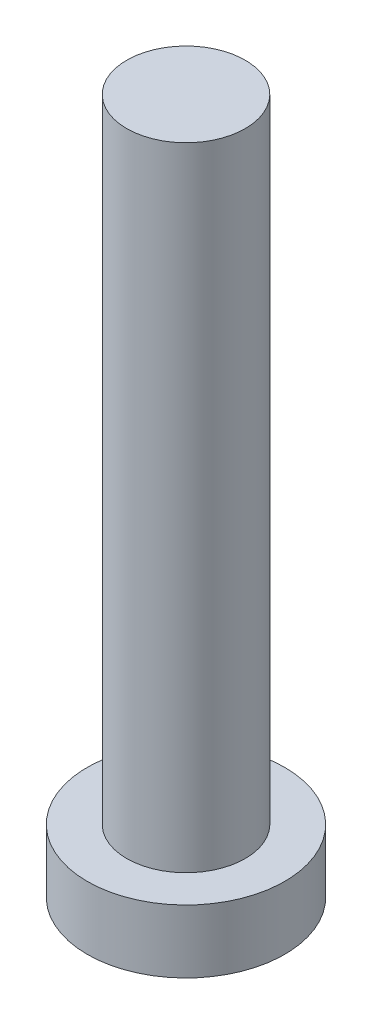
ISO-10303-21;
HEADER;
FILE_DESCRIPTION(('STEP AP214'),'2;1');
FILE_NAME('part.step','',(''),(''),'','','');
FILE_SCHEMA(('AUTOMOTIVE_DESIGN { 1 0 10303 214 1 1 1 1 }'));
ENDSEC;
DATA;
#1=APPLICATION_CONTEXT('core data for automotive mechanical design processes');
#2=APPLICATION_PROTOCOL_DEFINITION('international standard','automotive_design',2000,#1);
#3=PRODUCT_CONTEXT('',#1,'mechanical');
#4=PRODUCT('Part','Part','',(#3));
#5=PRODUCT_RELATED_PRODUCT_CATEGORY('part','',(#4));
#6=PRODUCT_DEFINITION_FORMATION('','',#4);
#7=PRODUCT_DEFINITION_CONTEXT('part definition',#1,'design');
#8=PRODUCT_DEFINITION('design','',#6,#7);
#9=PRODUCT_DEFINITION_SHAPE('','',#8);
#10=(LENGTH_UNIT() NAMED_UNIT(*) SI_UNIT(.MILLI.,.METRE.));
#11=(NAMED_UNIT(*) PLANE_ANGLE_UNIT() SI_UNIT($,.RADIAN.));
#12=(NAMED_UNIT(*) SI_UNIT($,.STERADIAN.) SOLID_ANGLE_UNIT());
#13=UNCERTAINTY_MEASURE_WITH_UNIT(LENGTH_MEASURE(1.E-05),#10,'distance_accuracy_value','');
#14=(GEOMETRIC_REPRESENTATION_CONTEXT(3) GLOBAL_UNCERTAINTY_ASSIGNED_CONTEXT((#13)) GLOBAL_UNIT_ASSIGNED_CONTEXT((#10,
#11,#12)) REPRESENTATION_CONTEXT('',''));
#15=CARTESIAN_POINT('',(0.,0.,0.));
#16=DIRECTION('',(0.,0.,1.));
#17=DIRECTION('',(1.,0.,0.));
#18=AXIS2_PLACEMENT_3D('',#15,#16,#17);
#19=CARTESIAN_POINT('',(0.,0.,0.));
#20=DIRECTION('',(0.,1.,0.));
#21=DIRECTION('',(0.,0.,1.));
#22=AXIS2_PLACEMENT_3D('',#19,#20,#21);
#23=PLANE('',#22);
#24=CARTESIAN_POINT('',(0.,0.,0.));
#25=DIRECTION('',(0.,1.,0.));
#26=DIRECTION('',(0.,0.,1.));
#27=AXIS2_PLACEMENT_3D('',#24,#25,#26);
#28=CIRCLE('',#27,2.5);
#29=CARTESIAN_POINT('',(0.,0.,2.5));
#30=VERTEX_POINT('',#29);
#31=EDGE_CURVE('E39',#30,#30,#28,.T.);
#32=ORIENTED_EDGE('',*,*,#31,.F.);
#33=EDGE_LOOP('',(#32));
#34=FACE_BOUND('',#33,.T.);
#35=CARTESIAN_POINT('',(1.,0.,1.));
#36=DIRECTION('',(0.,1.,0.));
#37=DIRECTION('',(0.,0.,-1.));
#38=AXIS2_PLACEMENT_3D('',#35,#36,#37);
#39=CIRCLE('',#38,0.5);
#40=CARTESIAN_POINT('',(1.,0.,0.5));
#41=VERTEX_POINT('',#40);
#42=CARTESIAN_POINT('',(0.5,0.,1.));
#43=VERTEX_POINT('',#42);
#44=EDGE_CURVE('E186',#41,#43,#39,.T.);
#45=ORIENTED_EDGE('',*,*,#44,.F.);
#46=DIRECTION('',(-1.,0.,0.));
#47=VECTOR('',#46,1.);
#48=CARTESIAN_POINT('',(1.,0.,0.5));
#49=LINE('',#48,#47);
#50=CARTESIAN_POINT('',(1.75,0.,0.5));
#51=VERTEX_POINT('',#50);
#52=EDGE_CURVE('E52',#51,#41,#49,.T.);
#53=ORIENTED_EDGE('',*,*,#52,.F.);
#54=DIRECTION('',(0.,0.,1.));
#55=VECTOR('',#54,1.);
#56=CARTESIAN_POINT('',(1.75,0.,-0.5));
#57=LINE('',#56,#55);
#58=CARTESIAN_POINT('',(1.75,0.,-0.5));
#59=VERTEX_POINT('',#58);
#60=EDGE_CURVE('E225',#59,#51,#57,.T.);
#61=ORIENTED_EDGE('',*,*,#60,.F.);
#62=DIRECTION('',(1.,0.,0.));
#63=VECTOR('',#62,1.);
#64=CARTESIAN_POINT('',(1.,0.,-0.5));
#65=LINE('',#64,#63);
#66=CARTESIAN_POINT('',(1.,0.,-0.5));
#67=VERTEX_POINT('',#66);
#68=EDGE_CURVE('E223',#67,#59,#65,.T.);
#69=ORIENTED_EDGE('',*,*,#68,.F.);
#70=CARTESIAN_POINT('',(1.,0.,-1.));
#71=DIRECTION('',(0.,1.,0.));
#72=DIRECTION('',(0.,0.,-1.));
#73=AXIS2_PLACEMENT_3D('',#70,#71,#72);
#74=CIRCLE('',#73,0.5);
#75=CARTESIAN_POINT('',(0.5,0.,-1.));
#76=VERTEX_POINT('',#75);
#77=EDGE_CURVE('E160',#76,#67,#74,.T.);
#78=ORIENTED_EDGE('',*,*,#77,.F.);
#79=DIRECTION('',(0.,0.,1.));
#80=VECTOR('',#79,1.);
#81=CARTESIAN_POINT('',(0.5,0.,-1.75));
#82=LINE('',#81,#80);
#83=CARTESIAN_POINT('',(0.5,0.,-1.75));
#84=VERTEX_POINT('',#83);
#85=EDGE_CURVE('E219',#84,#76,#82,.T.);
#86=ORIENTED_EDGE('',*,*,#85,.F.);
#87=DIRECTION('',(1.,0.,0.));
#88=VECTOR('',#87,1.);
#89=CARTESIAN_POINT('',(-0.5,0.,-1.75));
#90=LINE('',#89,#88);
#91=CARTESIAN_POINT('',(-0.5,0.,-1.75));
#92=VERTEX_POINT('',#91);
#93=EDGE_CURVE('E216',#92,#84,#90,.T.);
#94=ORIENTED_EDGE('',*,*,#93,.F.);
#95=DIRECTION('',(0.,0.,-1.));
#96=VECTOR('',#95,1.);
#97=CARTESIAN_POINT('',(-0.5,0.,-1.75));
#98=LINE('',#97,#96);
#99=CARTESIAN_POINT('',(-0.5,0.,-1.));
#100=VERTEX_POINT('',#99);
#101=EDGE_CURVE('E213',#100,#92,#98,.T.);
#102=ORIENTED_EDGE('',*,*,#101,.F.);
#103=CARTESIAN_POINT('',(-1.,0.,-1.));
#104=DIRECTION('',(0.,1.,0.));
#105=DIRECTION('',(0.,0.,-1.));
#106=AXIS2_PLACEMENT_3D('',#103,#104,#105);
#107=CIRCLE('',#106,0.5);
#108=CARTESIAN_POINT('',(-1.,0.,-0.5));
#109=VERTEX_POINT('',#108);
#110=EDGE_CURVE('E210',#109,#100,#107,.T.);
#111=ORIENTED_EDGE('',*,*,#110,.F.);
#112=DIRECTION('',(1.,0.,0.));
#113=VECTOR('',#112,1.);
#114=CARTESIAN_POINT('',(-1.75,0.,-0.5));
#115=LINE('',#114,#113);
#116=CARTESIAN_POINT('',(-1.75,0.,-0.5));
#117=VERTEX_POINT('',#116);
#118=EDGE_CURVE('E207',#117,#109,#115,.T.);
#119=ORIENTED_EDGE('',*,*,#118,.F.);
#120=DIRECTION('',(0.,0.,-1.));
#121=VECTOR('',#120,1.);
#122=CARTESIAN_POINT('',(-1.75,0.,-0.5));
#123=LINE('',#122,#121);
#124=CARTESIAN_POINT('',(-1.75,0.,0.5));
#125=VERTEX_POINT('',#124);
#126=EDGE_CURVE('E204',#125,#117,#123,.T.);
#127=ORIENTED_EDGE('',*,*,#126,.F.);
#128=DIRECTION('',(-1.,0.,0.));
#129=VECTOR('',#128,1.);
#130=CARTESIAN_POINT('',(-1.75,0.,0.5));
#131=LINE('',#130,#129);
#132=CARTESIAN_POINT('',(-1.,0.,0.5));
#133=VERTEX_POINT('',#132);
#134=EDGE_CURVE('E201',#133,#125,#131,.T.);
#135=ORIENTED_EDGE('',*,*,#134,.F.);
#136=CARTESIAN_POINT('',(-1.,0.,1.));
#137=DIRECTION('',(0.,1.,0.));
#138=DIRECTION('',(0.,0.,1.));
#139=AXIS2_PLACEMENT_3D('',#136,#137,#138);
#140=CIRCLE('',#139,0.5);
#141=CARTESIAN_POINT('',(-0.5,0.,1.));
#142=VERTEX_POINT('',#141);
#143=EDGE_CURVE('E198',#142,#133,#140,.T.);
#144=ORIENTED_EDGE('',*,*,#143,.F.);
#145=DIRECTION('',(0.,0.,-1.));
#146=VECTOR('',#145,1.);
#147=CARTESIAN_POINT('',(-0.5,0.,1.));
#148=LINE('',#147,#146);
#149=CARTESIAN_POINT('',(-0.5,0.,1.75));
#150=VERTEX_POINT('',#149);
#151=EDGE_CURVE('E195',#150,#142,#148,.T.);
#152=ORIENTED_EDGE('',*,*,#151,.F.);
#153=DIRECTION('',(-1.,0.,0.));
#154=VECTOR('',#153,1.);
#155=CARTESIAN_POINT('',(-0.5,0.,1.75));
#156=LINE('',#155,#154);
#157=CARTESIAN_POINT('',(0.5,0.,1.75));
#158=VERTEX_POINT('',#157);
#159=EDGE_CURVE('E192',#158,#150,#156,.T.);
#160=ORIENTED_EDGE('',*,*,#159,.F.);
#161=DIRECTION('',(0.,0.,1.));
#162=VECTOR('',#161,1.);
#163=CARTESIAN_POINT('',(0.5,0.,1.));
#164=LINE('',#163,#162);
#165=EDGE_CURVE('E189',#43,#158,#164,.T.);
#166=ORIENTED_EDGE('',*,*,#165,.F.);
#167=EDGE_LOOP('',(#45,#53,#61,#69,#78,#86,#94,#102,#111,#119,#127,#135,#144,#152,#160,#166));
#168=FACE_BOUND('',#167,.T.);
#169=ADVANCED_FACE('F35',(#34,#168),#23,.F.);
#170=CARTESIAN_POINT('',(0.,1.6,0.));
#171=DIRECTION('',(0.,-1.,0.));
#172=DIRECTION('',(0.,0.,-1.));
#173=AXIS2_PLACEMENT_3D('',#170,#171,#172);
#174=CYLINDRICAL_SURFACE('',#173,2.5);
#175=CARTESIAN_POINT('',(0.,1.6,0.));
#176=DIRECTION('',(0.,1.,0.));
#177=DIRECTION('',(0.,0.,1.));
#178=AXIS2_PLACEMENT_3D('',#175,#176,#177);
#179=CIRCLE('',#178,2.5);
#180=CARTESIAN_POINT('',(0.,1.6,2.5));
#181=VERTEX_POINT('',#180);
#182=EDGE_CURVE('E44',#181,#181,#179,.T.);
#183=ORIENTED_EDGE('',*,*,#182,.F.);
#184=EDGE_LOOP('',(#183));
#185=FACE_BOUND('',#184,.T.);
#186=ORIENTED_EDGE('',*,*,#31,.T.);
#187=EDGE_LOOP('',(#186));
#188=FACE_BOUND('',#187,.T.);
#189=ADVANCED_FACE('F37',(#185,#188),#174,.T.);
#190=CARTESIAN_POINT('',(0.,1.6,0.));
#191=DIRECTION('',(0.,1.,0.));
#192=DIRECTION('',(0.,0.,1.));
#193=AXIS2_PLACEMENT_3D('',#190,#191,#192);
#194=PLANE('',#193);
#195=CARTESIAN_POINT('',(0.,1.6,0.));
#196=DIRECTION('',(0.,1.,0.));
#197=DIRECTION('',(0.,0.,1.));
#198=AXIS2_PLACEMENT_3D('',#195,#196,#197);
#199=CIRCLE('',#198,1.5);
#200=CARTESIAN_POINT('',(0.,1.6,1.5));
#201=VERTEX_POINT('',#200);
#202=EDGE_CURVE('E11',#201,#201,#199,.T.);
#203=ORIENTED_EDGE('',*,*,#202,.F.);
#204=EDGE_LOOP('',(#203));
#205=FACE_BOUND('',#204,.T.);
#206=ORIENTED_EDGE('',*,*,#182,.T.);
#207=EDGE_LOOP('',(#206));
#208=FACE_BOUND('',#207,.T.);
#209=ADVANCED_FACE('F374',(#205,#208),#194,.T.);
#210=CARTESIAN_POINT('',(0.,17.6,0.));
#211=DIRECTION('',(0.,-1.,0.));
#212=DIRECTION('',(0.,0.,-1.));
#213=AXIS2_PLACEMENT_3D('',#210,#211,#212);
#214=CYLINDRICAL_SURFACE('',#213,1.5);
#215=CARTESIAN_POINT('',(0.,17.6,0.));
#216=DIRECTION('',(0.,1.,0.));
#217=DIRECTION('',(0.,0.,1.));
#218=AXIS2_PLACEMENT_3D('',#215,#216,#217);
#219=CIRCLE('',#218,1.5);
#220=CARTESIAN_POINT('',(0.,17.6,1.5));
#221=VERTEX_POINT('',#220);
#222=EDGE_CURVE('E229',#221,#221,#219,.T.);
#223=ORIENTED_EDGE('',*,*,#222,.F.);
#224=EDGE_LOOP('',(#223));
#225=FACE_BOUND('',#224,.T.);
#226=ORIENTED_EDGE('',*,*,#202,.T.);
#227=EDGE_LOOP('',(#226));
#228=FACE_BOUND('',#227,.T.);
#229=ADVANCED_FACE('F370',(#225,#228),#214,.T.);
#230=CARTESIAN_POINT('',(0.,17.6,0.));
#231=DIRECTION('',(0.,1.,0.));
#232=DIRECTION('',(0.,0.,1.));
#233=AXIS2_PLACEMENT_3D('',#230,#231,#232);
#234=PLANE('',#233);
#235=ORIENTED_EDGE('',*,*,#222,.T.);
#236=EDGE_LOOP('',(#235));
#237=FACE_BOUND('',#236,.T.);
#238=ADVANCED_FACE('F320',(#237),#234,.T.);
#239=CARTESIAN_POINT('',(1.,1.,0.5));
#240=DIRECTION('',(0.,0.,1.));
#241=DIRECTION('',(1.,0.,0.));
#242=AXIS2_PLACEMENT_3D('',#239,#240,#241);
#243=PLANE('',#242);
#244=ORIENTED_EDGE('',*,*,#52,.T.);
#245=DIRECTION('',(0.,-1.,0.));
#246=VECTOR('',#245,1.);
#247=CARTESIAN_POINT('',(1.,1.,0.5));
#248=LINE('',#247,#246);
#249=CARTESIAN_POINT('',(1.,1.,0.5));
#250=VERTEX_POINT('',#249);
#251=EDGE_CURVE('E112',#250,#41,#248,.T.);
#252=ORIENTED_EDGE('',*,*,#251,.F.);
#253=DIRECTION('',(-1.,0.,0.));
#254=VECTOR('',#253,1.);
#255=CARTESIAN_POINT('',(1.,1.,0.5));
#256=LINE('',#255,#254);
#257=CARTESIAN_POINT('',(1.75,1.,0.5));
#258=VERTEX_POINT('',#257);
#259=EDGE_CURVE('E227',#258,#250,#256,.T.);
#260=ORIENTED_EDGE('',*,*,#259,.F.);
#261=DIRECTION('',(0.,-1.,0.));
#262=VECTOR('',#261,1.);
#263=CARTESIAN_POINT('',(1.75,1.,0.5));
#264=LINE('',#263,#262);
#265=EDGE_CURVE('E60',#258,#51,#264,.T.);
#266=ORIENTED_EDGE('',*,*,#265,.T.);
#267=EDGE_LOOP('',(#244,#252,#260,#266));
#268=FACE_BOUND('',#267,.T.);
#269=ADVANCED_FACE('F313',(#268),#243,.F.);
#270=CARTESIAN_POINT('',(1.75,1.,-0.5));
#271=DIRECTION('',(1.,0.,0.));
#272=DIRECTION('',(0.,0.,-1.));
#273=AXIS2_PLACEMENT_3D('',#270,#271,#272);
#274=PLANE('',#273);
#275=ORIENTED_EDGE('',*,*,#60,.T.);
#276=ORIENTED_EDGE('',*,*,#265,.F.);
#277=DIRECTION('',(0.,0.,1.));
#278=VECTOR('',#277,1.);
#279=CARTESIAN_POINT('',(1.75,1.,-0.5));
#280=LINE('',#279,#278);
#281=CARTESIAN_POINT('',(1.75,1.,-0.5));
#282=VERTEX_POINT('',#281);
#283=EDGE_CURVE('E172',#282,#258,#280,.T.);
#284=ORIENTED_EDGE('',*,*,#283,.F.);
#285=DIRECTION('',(0.,-1.,0.));
#286=VECTOR('',#285,1.);
#287=CARTESIAN_POINT('',(1.75,1.,-0.5));
#288=LINE('',#287,#286);
#289=EDGE_CURVE('E164',#282,#59,#288,.T.);
#290=ORIENTED_EDGE('',*,*,#289,.T.);
#291=EDGE_LOOP('',(#275,#276,#284,#290));
#292=FACE_BOUND('',#291,.T.);
#293=ADVANCED_FACE('F311',(#292),#274,.F.);
#294=CARTESIAN_POINT('',(1.,1.,-0.5));
#295=DIRECTION('',(0.,0.,-1.));
#296=DIRECTION('',(-1.,0.,0.));
#297=AXIS2_PLACEMENT_3D('',#294,#295,#296);
#298=PLANE('',#297);
#299=ORIENTED_EDGE('',*,*,#68,.T.);
#300=ORIENTED_EDGE('',*,*,#289,.F.);
#301=DIRECTION('',(1.,0.,0.));
#302=VECTOR('',#301,1.);
#303=CARTESIAN_POINT('',(1.,1.,-0.5));
#304=LINE('',#303,#302);
#305=CARTESIAN_POINT('',(1.,1.,-0.5));
#306=VERTEX_POINT('',#305);
#307=EDGE_CURVE('E168',#306,#282,#304,.T.);
#308=ORIENTED_EDGE('',*,*,#307,.F.);
#309=DIRECTION('',(0.,-1.,0.));
#310=VECTOR('',#309,1.);
#311=CARTESIAN_POINT('',(1.,1.,-0.5));
#312=LINE('',#311,#310);
#313=EDGE_CURVE('E153',#306,#67,#312,.T.);
#314=ORIENTED_EDGE('',*,*,#313,.T.);
#315=EDGE_LOOP('',(#299,#300,#308,#314));
#316=FACE_BOUND('',#315,.T.);
#317=ADVANCED_FACE('F169',(#316),#298,.F.);
#318=CARTESIAN_POINT('',(1.,1.,-1.));
#319=DIRECTION('',(0.,-1.,0.));
#320=DIRECTION('',(0.,0.,-1.));
#321=AXIS2_PLACEMENT_3D('',#318,#319,#320);
#322=CYLINDRICAL_SURFACE('',#321,0.5);
#323=ORIENTED_EDGE('',*,*,#77,.T.);
#324=ORIENTED_EDGE('',*,*,#313,.F.);
#325=CARTESIAN_POINT('',(1.,1.,-1.));
#326=DIRECTION('',(0.,1.,0.));
#327=DIRECTION('',(0.,0.,-1.));
#328=AXIS2_PLACEMENT_3D('',#325,#326,#327);
#329=CIRCLE('',#328,0.5);
#330=CARTESIAN_POINT('',(0.5,1.,-1.));
#331=VERTEX_POINT('',#330);
#332=EDGE_CURVE('E157',#331,#306,#329,.T.);
#333=ORIENTED_EDGE('',*,*,#332,.F.);
#334=DIRECTION('',(0.,-1.,0.));
#335=VECTOR('',#334,1.);
#336=CARTESIAN_POINT('',(0.5,1.,-1.));
#337=LINE('',#336,#335);
#338=EDGE_CURVE('E165',#331,#76,#337,.T.);
#339=ORIENTED_EDGE('',*,*,#338,.T.);
#340=EDGE_LOOP('',(#323,#324,#333,#339));
#341=FACE_BOUND('',#340,.T.);
#342=ADVANCED_FACE('F155',(#341),#322,.T.);
#343=CARTESIAN_POINT('',(0.5,1.,-1.75));
#344=DIRECTION('',(1.,0.,0.));
#345=DIRECTION('',(0.,0.,-1.));
#346=AXIS2_PLACEMENT_3D('',#343,#344,#345);
#347=PLANE('',#346);
#348=ORIENTED_EDGE('',*,*,#85,.T.);
#349=ORIENTED_EDGE('',*,*,#338,.F.);
#350=DIRECTION('',(0.,0.,1.));
#351=VECTOR('',#350,1.);
#352=CARTESIAN_POINT('',(0.5,1.,-1.75));
#353=LINE('',#352,#351);
#354=CARTESIAN_POINT('',(0.5,1.,-1.75));
#355=VERTEX_POINT('',#354);
#356=EDGE_CURVE('E178',#355,#331,#353,.T.);
#357=ORIENTED_EDGE('',*,*,#356,.F.);
#358=DIRECTION('',(0.,-1.,0.));
#359=VECTOR('',#358,1.);
#360=CARTESIAN_POINT('',(0.5,1.,-1.75));
#361=LINE('',#360,#359);
#362=EDGE_CURVE('E232',#355,#84,#361,.T.);
#363=ORIENTED_EDGE('',*,*,#362,.T.);
#364=EDGE_LOOP('',(#348,#349,#357,#363));
#365=FACE_BOUND('',#364,.T.);
#366=ADVANCED_FACE('F310',(#365),#347,.F.);
#367=CARTESIAN_POINT('',(-0.5,1.,-1.75));
#368=DIRECTION('',(0.,0.,-1.));
#369=DIRECTION('',(-1.,0.,0.));
#370=AXIS2_PLACEMENT_3D('',#367,#368,#369);
#371=PLANE('',#370);
#372=ORIENTED_EDGE('',*,*,#93,.T.);
#373=ORIENTED_EDGE('',*,*,#362,.F.);
#374=DIRECTION('',(1.,0.,0.));
#375=VECTOR('',#374,1.);
#376=CARTESIAN_POINT('',(-0.5,1.,-1.75));
#377=LINE('',#376,#375);
#378=CARTESIAN_POINT('',(-0.5,1.,-1.75));
#379=VERTEX_POINT('',#378);
#380=EDGE_CURVE('E180',#379,#355,#377,.T.);
#381=ORIENTED_EDGE('',*,*,#380,.F.);
#382=DIRECTION('',(0.,-1.,0.));
#383=VECTOR('',#382,1.);
#384=CARTESIAN_POINT('',(-0.5,1.,-1.75));
#385=LINE('',#384,#383);
#386=EDGE_CURVE('E234',#379,#92,#385,.T.);
#387=ORIENTED_EDGE('',*,*,#386,.T.);
#388=EDGE_LOOP('',(#372,#373,#381,#387));
#389=FACE_BOUND('',#388,.T.);
#390=ADVANCED_FACE('F306',(#389),#371,.F.);
#391=CARTESIAN_POINT('',(-0.5,1.,-1.75));
#392=DIRECTION('',(-1.,0.,0.));
#393=DIRECTION('',(0.,0.,1.));
#394=AXIS2_PLACEMENT_3D('',#391,#392,#393);
#395=PLANE('',#394);
#396=ORIENTED_EDGE('',*,*,#101,.T.);
#397=ORIENTED_EDGE('',*,*,#386,.F.);
#398=DIRECTION('',(0.,0.,-1.));
#399=VECTOR('',#398,1.);
#400=CARTESIAN_POINT('',(-0.5,1.,-1.75));
#401=LINE('',#400,#399);
#402=CARTESIAN_POINT('',(-0.5,1.,-1.));
#403=VERTEX_POINT('',#402);
#404=EDGE_CURVE('E301',#403,#379,#401,.T.);
#405=ORIENTED_EDGE('',*,*,#404,.F.);
#406=DIRECTION('',(0.,-1.,0.));
#407=VECTOR('',#406,1.);
#408=CARTESIAN_POINT('',(-0.5,1.,-1.));
#409=LINE('',#408,#407);
#410=EDGE_CURVE('E236',#403,#100,#409,.T.);
#411=ORIENTED_EDGE('',*,*,#410,.T.);
#412=EDGE_LOOP('',(#396,#397,#405,#411));
#413=FACE_BOUND('',#412,.T.);
#414=ADVANCED_FACE('F330',(#413),#395,.F.);
#415=CARTESIAN_POINT('',(-1.,1.,-1.));
#416=DIRECTION('',(0.,-1.,0.));
#417=DIRECTION('',(0.,0.,-1.));
#418=AXIS2_PLACEMENT_3D('',#415,#416,#417);
#419=CYLINDRICAL_SURFACE('',#418,0.5);
#420=ORIENTED_EDGE('',*,*,#110,.T.);
#421=ORIENTED_EDGE('',*,*,#410,.F.);
#422=CARTESIAN_POINT('',(-1.,1.,-1.));
#423=DIRECTION('',(0.,1.,0.));
#424=DIRECTION('',(0.,0.,-1.));
#425=AXIS2_PLACEMENT_3D('',#422,#423,#424);
#426=CIRCLE('',#425,0.5);
#427=CARTESIAN_POINT('',(-1.,1.,-0.5));
#428=VERTEX_POINT('',#427);
#429=EDGE_CURVE('E298',#428,#403,#426,.T.);
#430=ORIENTED_EDGE('',*,*,#429,.F.);
#431=DIRECTION('',(0.,-1.,0.));
#432=VECTOR('',#431,1.);
#433=CARTESIAN_POINT('',(-1.,1.,-0.5));
#434=LINE('',#433,#432);
#435=EDGE_CURVE('E238',#428,#109,#434,.T.);
#436=ORIENTED_EDGE('',*,*,#435,.T.);
#437=EDGE_LOOP('',(#420,#421,#430,#436));
#438=FACE_BOUND('',#437,.T.);
#439=ADVANCED_FACE('F333',(#438),#419,.T.);
#440=CARTESIAN_POINT('',(-1.75,1.,-0.5));
#441=DIRECTION('',(0.,0.,-1.));
#442=DIRECTION('',(-1.,0.,0.));
#443=AXIS2_PLACEMENT_3D('',#440,#441,#442);
#444=PLANE('',#443);
#445=ORIENTED_EDGE('',*,*,#118,.T.);
#446=ORIENTED_EDGE('',*,*,#435,.F.);
#447=DIRECTION('',(1.,0.,0.));
#448=VECTOR('',#447,1.);
#449=CARTESIAN_POINT('',(-1.75,1.,-0.5));
#450=LINE('',#449,#448);
#451=CARTESIAN_POINT('',(-1.75,1.,-0.5));
#452=VERTEX_POINT('',#451);
#453=EDGE_CURVE('E295',#452,#428,#450,.T.);
#454=ORIENTED_EDGE('',*,*,#453,.F.);
#455=DIRECTION('',(0.,-1.,0.));
#456=VECTOR('',#455,1.);
#457=CARTESIAN_POINT('',(-1.75,1.,-0.5));
#458=LINE('',#457,#456);
#459=EDGE_CURVE('E240',#452,#117,#458,.T.);
#460=ORIENTED_EDGE('',*,*,#459,.T.);
#461=EDGE_LOOP('',(#445,#446,#454,#460));
#462=FACE_BOUND('',#461,.T.);
#463=ADVANCED_FACE('F337',(#462),#444,.F.);
#464=CARTESIAN_POINT('',(-1.75,1.,-0.5));
#465=DIRECTION('',(-1.,0.,0.));
#466=DIRECTION('',(0.,0.,1.));
#467=AXIS2_PLACEMENT_3D('',#464,#465,#466);
#468=PLANE('',#467);
#469=ORIENTED_EDGE('',*,*,#126,.T.);
#470=ORIENTED_EDGE('',*,*,#459,.F.);
#471=DIRECTION('',(0.,0.,-1.));
#472=VECTOR('',#471,1.);
#473=CARTESIAN_POINT('',(-1.75,1.,-0.5));
#474=LINE('',#473,#472);
#475=CARTESIAN_POINT('',(-1.75,1.,0.5));
#476=VERTEX_POINT('',#475);
#477=EDGE_CURVE('E292',#476,#452,#474,.T.);
#478=ORIENTED_EDGE('',*,*,#477,.F.);
#479=DIRECTION('',(0.,-1.,0.));
#480=VECTOR('',#479,1.);
#481=CARTESIAN_POINT('',(-1.75,1.,0.5));
#482=LINE('',#481,#480);
#483=EDGE_CURVE('E242',#476,#125,#482,.T.);
#484=ORIENTED_EDGE('',*,*,#483,.T.);
#485=EDGE_LOOP('',(#469,#470,#478,#484));
#486=FACE_BOUND('',#485,.T.);
#487=ADVANCED_FACE('F341',(#486),#468,.F.);
#488=CARTESIAN_POINT('',(-1.75,1.,0.5));
#489=DIRECTION('',(0.,0.,1.));
#490=DIRECTION('',(1.,0.,0.));
#491=AXIS2_PLACEMENT_3D('',#488,#489,#490);
#492=PLANE('',#491);
#493=ORIENTED_EDGE('',*,*,#134,.T.);
#494=ORIENTED_EDGE('',*,*,#483,.F.);
#495=DIRECTION('',(-1.,0.,0.));
#496=VECTOR('',#495,1.);
#497=CARTESIAN_POINT('',(-1.75,1.,0.5));
#498=LINE('',#497,#496);
#499=CARTESIAN_POINT('',(-1.,1.,0.5));
#500=VERTEX_POINT('',#499);
#501=EDGE_CURVE('E289',#500,#476,#498,.T.);
#502=ORIENTED_EDGE('',*,*,#501,.F.);
#503=DIRECTION('',(0.,-1.,0.));
#504=VECTOR('',#503,1.);
#505=CARTESIAN_POINT('',(-1.,1.,0.5));
#506=LINE('',#505,#504);
#507=EDGE_CURVE('E244',#500,#133,#506,.T.);
#508=ORIENTED_EDGE('',*,*,#507,.T.);
#509=EDGE_LOOP('',(#493,#494,#502,#508));
#510=FACE_BOUND('',#509,.T.);
#511=ADVANCED_FACE('F345',(#510),#492,.F.);
#512=CARTESIAN_POINT('',(-1.,1.,1.));
#513=DIRECTION('',(0.,-1.,0.));
#514=DIRECTION('',(0.,0.,-1.));
#515=AXIS2_PLACEMENT_3D('',#512,#513,#514);
#516=CYLINDRICAL_SURFACE('',#515,0.5);
#517=ORIENTED_EDGE('',*,*,#143,.T.);
#518=ORIENTED_EDGE('',*,*,#507,.F.);
#519=CARTESIAN_POINT('',(-1.,1.,1.));
#520=DIRECTION('',(0.,1.,0.));
#521=DIRECTION('',(0.,0.,1.));
#522=AXIS2_PLACEMENT_3D('',#519,#520,#521);
#523=CIRCLE('',#522,0.5);
#524=CARTESIAN_POINT('',(-0.5,1.,1.));
#525=VERTEX_POINT('',#524);
#526=EDGE_CURVE('E286',#525,#500,#523,.T.);
#527=ORIENTED_EDGE('',*,*,#526,.F.);
#528=DIRECTION('',(0.,-1.,0.));
#529=VECTOR('',#528,1.);
#530=CARTESIAN_POINT('',(-0.5,1.,1.));
#531=LINE('',#530,#529);
#532=EDGE_CURVE('E246',#525,#142,#531,.T.);
#533=ORIENTED_EDGE('',*,*,#532,.T.);
#534=EDGE_LOOP('',(#517,#518,#527,#533));
#535=FACE_BOUND('',#534,.T.);
#536=ADVANCED_FACE('F349',(#535),#516,.T.);
#537=CARTESIAN_POINT('',(-0.5,1.,1.));
#538=DIRECTION('',(-1.,0.,0.));
#539=DIRECTION('',(0.,0.,1.));
#540=AXIS2_PLACEMENT_3D('',#537,#538,#539);
#541=PLANE('',#540);
#542=ORIENTED_EDGE('',*,*,#151,.T.);
#543=ORIENTED_EDGE('',*,*,#532,.F.);
#544=DIRECTION('',(0.,0.,-1.));
#545=VECTOR('',#544,1.);
#546=CARTESIAN_POINT('',(-0.5,1.,1.));
#547=LINE('',#546,#545);
#548=CARTESIAN_POINT('',(-0.5,1.,1.75));
#549=VERTEX_POINT('',#548);
#550=EDGE_CURVE('E283',#549,#525,#547,.T.);
#551=ORIENTED_EDGE('',*,*,#550,.F.);
#552=DIRECTION('',(0.,-1.,0.));
#553=VECTOR('',#552,1.);
#554=CARTESIAN_POINT('',(-0.5,1.,1.75));
#555=LINE('',#554,#553);
#556=EDGE_CURVE('E248',#549,#150,#555,.T.);
#557=ORIENTED_EDGE('',*,*,#556,.T.);
#558=EDGE_LOOP('',(#542,#543,#551,#557));
#559=FACE_BOUND('',#558,.T.);
#560=ADVANCED_FACE('F353',(#559),#541,.F.);
#561=CARTESIAN_POINT('',(-0.5,1.,1.75));
#562=DIRECTION('',(0.,0.,1.));
#563=DIRECTION('',(1.,0.,0.));
#564=AXIS2_PLACEMENT_3D('',#561,#562,#563);
#565=PLANE('',#564);
#566=ORIENTED_EDGE('',*,*,#159,.T.);
#567=ORIENTED_EDGE('',*,*,#556,.F.);
#568=DIRECTION('',(-1.,0.,0.));
#569=VECTOR('',#568,1.);
#570=CARTESIAN_POINT('',(-0.5,1.,1.75));
#571=LINE('',#570,#569);
#572=CARTESIAN_POINT('',(0.5,1.,1.75));
#573=VERTEX_POINT('',#572);
#574=EDGE_CURVE('E280',#573,#549,#571,.T.);
#575=ORIENTED_EDGE('',*,*,#574,.F.);
#576=DIRECTION('',(0.,-1.,0.));
#577=VECTOR('',#576,1.);
#578=CARTESIAN_POINT('',(0.5,1.,1.75));
#579=LINE('',#578,#577);
#580=EDGE_CURVE('E250',#573,#158,#579,.T.);
#581=ORIENTED_EDGE('',*,*,#580,.T.);
#582=EDGE_LOOP('',(#566,#567,#575,#581));
#583=FACE_BOUND('',#582,.T.);
#584=ADVANCED_FACE('F357',(#583),#565,.F.);
#585=CARTESIAN_POINT('',(0.5,1.,1.));
#586=DIRECTION('',(1.,0.,0.));
#587=DIRECTION('',(0.,0.,-1.));
#588=AXIS2_PLACEMENT_3D('',#585,#586,#587);
#589=PLANE('',#588);
#590=ORIENTED_EDGE('',*,*,#165,.T.);
#591=ORIENTED_EDGE('',*,*,#580,.F.);
#592=DIRECTION('',(0.,0.,1.));
#593=VECTOR('',#592,1.);
#594=CARTESIAN_POINT('',(0.5,1.,1.));
#595=LINE('',#594,#593);
#596=CARTESIAN_POINT('',(0.5,1.,1.));
#597=VERTEX_POINT('',#596);
#598=EDGE_CURVE('E275',#597,#573,#595,.T.);
#599=ORIENTED_EDGE('',*,*,#598,.F.);
#600=DIRECTION('',(0.,-1.,0.));
#601=VECTOR('',#600,1.);
#602=CARTESIAN_POINT('',(0.5,1.,1.));
#603=LINE('',#602,#601);
#604=EDGE_CURVE('E252',#597,#43,#603,.T.);
#605=ORIENTED_EDGE('',*,*,#604,.T.);
#606=EDGE_LOOP('',(#590,#591,#599,#605));
#607=FACE_BOUND('',#606,.T.);
#608=ADVANCED_FACE('F361',(#607),#589,.F.);
#609=CARTESIAN_POINT('',(1.,1.,1.));
#610=DIRECTION('',(0.,-1.,0.));
#611=DIRECTION('',(0.,0.,-1.));
#612=AXIS2_PLACEMENT_3D('',#609,#610,#611);
#613=CYLINDRICAL_SURFACE('',#612,0.5);
#614=ORIENTED_EDGE('',*,*,#44,.T.);
#615=ORIENTED_EDGE('',*,*,#604,.F.);
#616=CARTESIAN_POINT('',(1.,1.,1.));
#617=DIRECTION('',(0.,1.,0.));
#618=DIRECTION('',(0.,0.,-1.));
#619=AXIS2_PLACEMENT_3D('',#616,#617,#618);
#620=CIRCLE('',#619,0.5);
#621=EDGE_CURVE('E273',#250,#597,#620,.T.);
#622=ORIENTED_EDGE('',*,*,#621,.F.);
#623=ORIENTED_EDGE('',*,*,#251,.T.);
#624=EDGE_LOOP('',(#614,#615,#622,#623));
#625=FACE_BOUND('',#624,.T.);
#626=ADVANCED_FACE('F270',(#625),#613,.T.);
#627=CARTESIAN_POINT('',(1.,1.,-1.));
#628=DIRECTION('',(0.,-1.,0.));
#629=DIRECTION('',(0.,0.,-1.));
#630=AXIS2_PLACEMENT_3D('',#627,#628,#629);
#631=PLANE('',#630);
#632=ORIENTED_EDGE('',*,*,#259,.T.);
#633=ORIENTED_EDGE('',*,*,#621,.T.);
#634=ORIENTED_EDGE('',*,*,#598,.T.);
#635=ORIENTED_EDGE('',*,*,#574,.T.);
#636=ORIENTED_EDGE('',*,*,#550,.T.);
#637=ORIENTED_EDGE('',*,*,#526,.T.);
#638=ORIENTED_EDGE('',*,*,#501,.T.);
#639=ORIENTED_EDGE('',*,*,#477,.T.);
#640=ORIENTED_EDGE('',*,*,#453,.T.);
#641=ORIENTED_EDGE('',*,*,#429,.T.);
#642=ORIENTED_EDGE('',*,*,#404,.T.);
#643=ORIENTED_EDGE('',*,*,#380,.T.);
#644=ORIENTED_EDGE('',*,*,#356,.T.);
#645=ORIENTED_EDGE('',*,*,#332,.T.);
#646=ORIENTED_EDGE('',*,*,#307,.T.);
#647=ORIENTED_EDGE('',*,*,#283,.T.);
#648=EDGE_LOOP('',(#632,#633,#634,#635,#636,#637,#638,#639,#640,#641,#642,#643,#644,#645,#646,#647));
#649=FACE_BOUND('',#648,.T.);
#650=ADVANCED_FACE('F175',(#649),#631,.T.);
#651=CLOSED_SHELL('',(#169,#189,#209,#229,#238,#269,#293,#317,#342,#366,#390,#414,#439,#463,
#487,#511,#536,#560,#584,#608,#626,#650));
#652=MANIFOLD_SOLID_BREP('B2',#651);
#653=ADVANCED_BREP_SHAPE_REPRESENTATION('',(#18,#652),#14);
#654=SHAPE_DEFINITION_REPRESENTATION(#9,#653);
ENDSEC;
END-ISO-10303-21;
